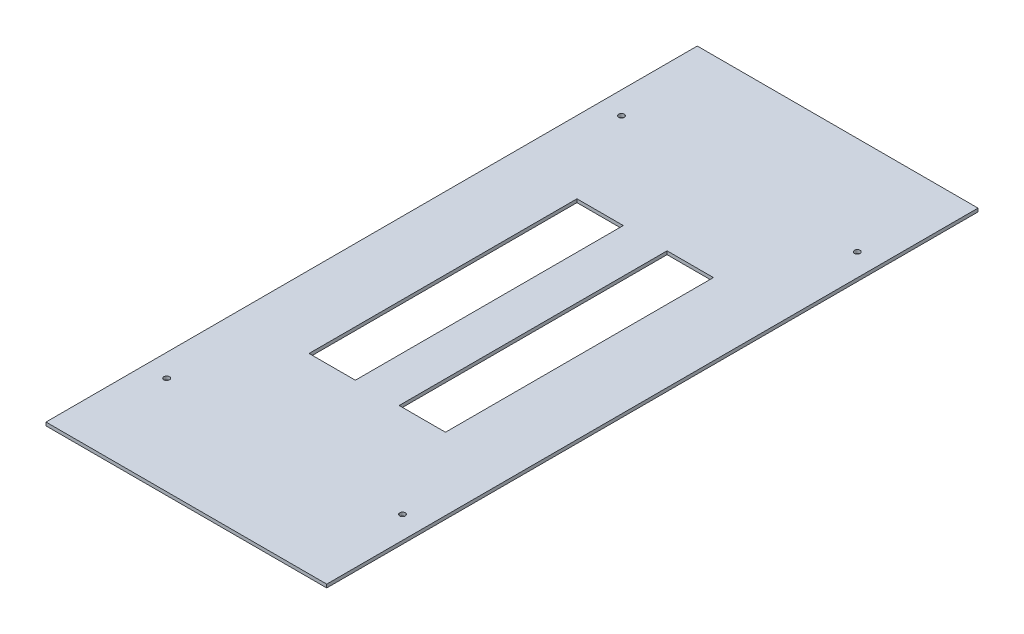
ISO-10303-21;
HEADER;
FILE_DESCRIPTION(('STEP AP214'),'2;1');
FILE_NAME('part.step','',(''),(''),'','','');
FILE_SCHEMA(('AUTOMOTIVE_DESIGN { 1 0 10303 214 1 1 1 1 }'));
ENDSEC;
DATA;
#1=APPLICATION_CONTEXT('core data for automotive mechanical design processes');
#2=APPLICATION_PROTOCOL_DEFINITION('international standard','automotive_design',2000,#1);
#3=PRODUCT_CONTEXT('',#1,'mechanical');
#4=PRODUCT('Part','Part','',(#3));
#5=PRODUCT_RELATED_PRODUCT_CATEGORY('part','',(#4));
#6=PRODUCT_DEFINITION_FORMATION('','',#4);
#7=PRODUCT_DEFINITION_CONTEXT('part definition',#1,'design');
#8=PRODUCT_DEFINITION('design','',#6,#7);
#9=PRODUCT_DEFINITION_SHAPE('','',#8);
#10=(LENGTH_UNIT() NAMED_UNIT(*) SI_UNIT(.MILLI.,.METRE.));
#11=(NAMED_UNIT(*) PLANE_ANGLE_UNIT() SI_UNIT($,.RADIAN.));
#12=(NAMED_UNIT(*) SI_UNIT($,.STERADIAN.) SOLID_ANGLE_UNIT());
#13=UNCERTAINTY_MEASURE_WITH_UNIT(LENGTH_MEASURE(1.E-05),#10,'distance_accuracy_value','');
#14=(GEOMETRIC_REPRESENTATION_CONTEXT(3) GLOBAL_UNCERTAINTY_ASSIGNED_CONTEXT((#13)) GLOBAL_UNIT_ASSIGNED_CONTEXT((#10,
#11,#12)) REPRESENTATION_CONTEXT('',''));
#15=CARTESIAN_POINT('',(0.,0.,0.));
#16=DIRECTION('',(0.,0.,1.));
#17=DIRECTION('',(1.,0.,0.));
#18=AXIS2_PLACEMENT_3D('',#15,#16,#17);
#19=CARTESIAN_POINT('',(0.,-3.,0.));
#20=DIRECTION('',(0.,1.,0.));
#21=DIRECTION('',(0.,0.,1.));
#22=AXIS2_PLACEMENT_3D('',#19,#20,#21);
#23=PLANE('',#22);
#24=DIRECTION('',(-1.,0.,0.));
#25=VECTOR('',#24,1.);
#26=CARTESIAN_POINT('',(-60.75,-3.,-118.6));
#27=LINE('',#26,#25);
#28=CARTESIAN_POINT('',(-19.5,-3.,-118.6));
#29=VERTEX_POINT('',#28);
#30=CARTESIAN_POINT('',(-60.75,-3.,-118.6));
#31=VERTEX_POINT('',#30);
#32=EDGE_CURVE('E184',#29,#31,#27,.T.);
#33=ORIENTED_EDGE('',*,*,#32,.T.);
#34=DIRECTION('',(0.,0.,1.));
#35=VECTOR('',#34,1.);
#36=CARTESIAN_POINT('',(-60.75,-3.,-118.6));
#37=LINE('',#36,#35);
#38=CARTESIAN_POINT('',(-60.75,-3.,120.));
#39=VERTEX_POINT('',#38);
#40=EDGE_CURVE('E173',#31,#39,#37,.T.);
#41=ORIENTED_EDGE('',*,*,#40,.T.);
#42=DIRECTION('',(1.,0.,0.));
#43=VECTOR('',#42,1.);
#44=CARTESIAN_POINT('',(-60.75,-3.,120.));
#45=LINE('',#44,#43);
#46=CARTESIAN_POINT('',(-19.5,-3.,120.));
#47=VERTEX_POINT('',#46);
#48=EDGE_CURVE('E177',#39,#47,#45,.T.);
#49=ORIENTED_EDGE('',*,*,#48,.T.);
#50=DIRECTION('',(0.,0.,-1.));
#51=VECTOR('',#50,1.);
#52=CARTESIAN_POINT('',(-19.5,-3.,-118.6));
#53=LINE('',#52,#51);
#54=EDGE_CURVE('E54',#47,#29,#53,.T.);
#55=ORIENTED_EDGE('',*,*,#54,.T.);
#56=EDGE_LOOP('',(#33,#41,#49,#55));
#57=FACE_BOUND('',#56,.T.);
#58=DIRECTION('',(0.,0.,-1.));
#59=VECTOR('',#58,1.);
#60=CARTESIAN_POINT('',(60.75,-3.,-118.6));
#61=LINE('',#60,#59);
#62=CARTESIAN_POINT('',(60.75,-3.,120.));
#63=VERTEX_POINT('',#62);
#64=CARTESIAN_POINT('',(60.75,-3.,-118.6));
#65=VERTEX_POINT('',#64);
#66=EDGE_CURVE('E228',#63,#65,#61,.T.);
#67=ORIENTED_EDGE('',*,*,#66,.T.);
#68=DIRECTION('',(-1.,0.,0.));
#69=VECTOR('',#68,1.);
#70=CARTESIAN_POINT('',(60.75,-3.,-118.6));
#71=LINE('',#70,#69);
#72=CARTESIAN_POINT('',(19.5,-3.,-118.6));
#73=VERTEX_POINT('',#72);
#74=EDGE_CURVE('E217',#65,#73,#71,.T.);
#75=ORIENTED_EDGE('',*,*,#74,.T.);
#76=DIRECTION('',(0.,0.,1.));
#77=VECTOR('',#76,1.);
#78=CARTESIAN_POINT('',(19.5,-3.,-118.6));
#79=LINE('',#78,#77);
#80=CARTESIAN_POINT('',(19.5,-3.,120.));
#81=VERTEX_POINT('',#80);
#82=EDGE_CURVE('E221',#73,#81,#79,.T.);
#83=ORIENTED_EDGE('',*,*,#82,.T.);
#84=DIRECTION('',(1.,0.,0.));
#85=VECTOR('',#84,1.);
#86=CARTESIAN_POINT('',(60.75,-3.,120.));
#87=LINE('',#86,#85);
#88=EDGE_CURVE('E62',#81,#63,#87,.T.);
#89=ORIENTED_EDGE('',*,*,#88,.T.);
#90=EDGE_LOOP('',(#67,#75,#83,#89));
#91=FACE_BOUND('',#90,.T.);
#92=CARTESIAN_POINT('',(-105.,-3.,-202.5));
#93=DIRECTION('',(0.,1.,0.));
#94=DIRECTION('',(0.,0.,1.));
#95=AXIS2_PLACEMENT_3D('',#92,#93,#94);
#96=CIRCLE('',#95,2.5);
#97=CARTESIAN_POINT('',(-105.,-3.,-200.));
#98=VERTEX_POINT('',#97);
#99=EDGE_CURVE('E262',#98,#98,#96,.T.);
#100=ORIENTED_EDGE('',*,*,#99,.T.);
#101=EDGE_LOOP('',(#100));
#102=FACE_BOUND('',#101,.T.);
#103=CARTESIAN_POINT('',(105.,-3.,-202.5));
#104=DIRECTION('',(0.,1.,0.));
#105=DIRECTION('',(0.,0.,1.));
#106=AXIS2_PLACEMENT_3D('',#103,#104,#105);
#107=CIRCLE('',#106,2.5);
#108=CARTESIAN_POINT('',(105.,-3.,-200.));
#109=VERTEX_POINT('',#108);
#110=EDGE_CURVE('E270',#109,#109,#107,.T.);
#111=ORIENTED_EDGE('',*,*,#110,.T.);
#112=EDGE_LOOP('',(#111));
#113=FACE_BOUND('',#112,.T.);
#114=CARTESIAN_POINT('',(105.,-3.,202.5));
#115=DIRECTION('',(0.,1.,0.));
#116=DIRECTION('',(0.,0.,1.));
#117=AXIS2_PLACEMENT_3D('',#114,#115,#116);
#118=CIRCLE('',#117,2.5);
#119=CARTESIAN_POINT('',(105.,-3.,205.));
#120=VERTEX_POINT('',#119);
#121=EDGE_CURVE('E278',#120,#120,#118,.T.);
#122=ORIENTED_EDGE('',*,*,#121,.T.);
#123=EDGE_LOOP('',(#122));
#124=FACE_BOUND('',#123,.T.);
#125=CARTESIAN_POINT('',(-105.,-3.,202.5));
#126=DIRECTION('',(0.,1.,0.));
#127=DIRECTION('',(0.,0.,1.));
#128=AXIS2_PLACEMENT_3D('',#125,#126,#127);
#129=CIRCLE('',#128,2.5);
#130=CARTESIAN_POINT('',(-105.,-3.,205.));
#131=VERTEX_POINT('',#130);
#132=EDGE_CURVE('E11',#131,#131,#129,.T.);
#133=ORIENTED_EDGE('',*,*,#132,.T.);
#134=EDGE_LOOP('',(#133));
#135=FACE_BOUND('',#134,.T.);
#136=DIRECTION('',(0.,0.,1.));
#137=VECTOR('',#136,1.);
#138=CARTESIAN_POINT('',(125.,-3.,290.));
#139=LINE('',#138,#137);
#140=CARTESIAN_POINT('',(125.,-3.,-290.));
#141=VERTEX_POINT('',#140);
#142=CARTESIAN_POINT('',(125.,-3.,290.));
#143=VERTEX_POINT('',#142);
#144=EDGE_CURVE('E136',#141,#143,#139,.T.);
#145=ORIENTED_EDGE('',*,*,#144,.T.);
#146=DIRECTION('',(-1.,0.,0.));
#147=VECTOR('',#146,1.);
#148=CARTESIAN_POINT('',(-125.,-3.,290.));
#149=LINE('',#148,#147);
#150=CARTESIAN_POINT('',(-125.,-3.,290.));
#151=VERTEX_POINT('',#150);
#152=EDGE_CURVE('E372',#143,#151,#149,.T.);
#153=ORIENTED_EDGE('',*,*,#152,.T.);
#154=DIRECTION('',(0.,0.,-1.));
#155=VECTOR('',#154,1.);
#156=CARTESIAN_POINT('',(-125.,-3.,290.));
#157=LINE('',#156,#155);
#158=CARTESIAN_POINT('',(-125.,-3.,-290.));
#159=VERTEX_POINT('',#158);
#160=EDGE_CURVE('E167',#151,#159,#157,.T.);
#161=ORIENTED_EDGE('',*,*,#160,.T.);
#162=DIRECTION('',(1.,0.,0.));
#163=VECTOR('',#162,1.);
#164=CARTESIAN_POINT('',(-125.,-3.,-290.));
#165=LINE('',#164,#163);
#166=EDGE_CURVE('E237',#159,#141,#165,.T.);
#167=ORIENTED_EDGE('',*,*,#166,.T.);
#168=EDGE_LOOP('',(#145,#153,#161,#167));
#169=FACE_BOUND('',#168,.T.);
#170=ADVANCED_FACE('F38',(#57,#91,#102,#113,#124,#135,#169),#23,.F.);
#171=CARTESIAN_POINT('',(0.,0.,0.));
#172=DIRECTION('',(0.,1.,0.));
#173=DIRECTION('',(0.,0.,1.));
#174=AXIS2_PLACEMENT_3D('',#171,#172,#173);
#175=PLANE('',#174);
#176=DIRECTION('',(0.,0.,1.));
#177=VECTOR('',#176,1.);
#178=CARTESIAN_POINT('',(-60.75,0.,-118.6));
#179=LINE('',#178,#177);
#180=CARTESIAN_POINT('',(-60.75,0.,-118.6));
#181=VERTEX_POINT('',#180);
#182=CARTESIAN_POINT('',(-60.75,0.,120.));
#183=VERTEX_POINT('',#182);
#184=EDGE_CURVE('E189',#181,#183,#179,.T.);
#185=ORIENTED_EDGE('',*,*,#184,.F.);
#186=DIRECTION('',(-1.,0.,0.));
#187=VECTOR('',#186,1.);
#188=CARTESIAN_POINT('',(-60.75,0.,-118.6));
#189=LINE('',#188,#187);
#190=CARTESIAN_POINT('',(-19.5,0.,-118.6));
#191=VERTEX_POINT('',#190);
#192=EDGE_CURVE('E178',#191,#181,#189,.T.);
#193=ORIENTED_EDGE('',*,*,#192,.F.);
#194=DIRECTION('',(0.,0.,-1.));
#195=VECTOR('',#194,1.);
#196=CARTESIAN_POINT('',(-19.5,0.,-118.6));
#197=LINE('',#196,#195);
#198=CARTESIAN_POINT('',(-19.5,0.,120.));
#199=VERTEX_POINT('',#198);
#200=EDGE_CURVE('E197',#199,#191,#197,.T.);
#201=ORIENTED_EDGE('',*,*,#200,.F.);
#202=DIRECTION('',(1.,0.,0.));
#203=VECTOR('',#202,1.);
#204=CARTESIAN_POINT('',(-60.75,0.,120.));
#205=LINE('',#204,#203);
#206=EDGE_CURVE('E192',#183,#199,#205,.T.);
#207=ORIENTED_EDGE('',*,*,#206,.F.);
#208=EDGE_LOOP('',(#185,#193,#201,#207));
#209=FACE_BOUND('',#208,.T.);
#210=DIRECTION('',(-1.,0.,0.));
#211=VECTOR('',#210,1.);
#212=CARTESIAN_POINT('',(60.75,0.,-118.6));
#213=LINE('',#212,#211);
#214=CARTESIAN_POINT('',(60.75,0.,-118.6));
#215=VERTEX_POINT('',#214);
#216=CARTESIAN_POINT('',(19.5,0.,-118.6));
#217=VERTEX_POINT('',#216);
#218=EDGE_CURVE('E233',#215,#217,#213,.T.);
#219=ORIENTED_EDGE('',*,*,#218,.F.);
#220=DIRECTION('',(0.,0.,-1.));
#221=VECTOR('',#220,1.);
#222=CARTESIAN_POINT('',(60.75,0.,-118.6));
#223=LINE('',#222,#221);
#224=CARTESIAN_POINT('',(60.75,0.,120.));
#225=VERTEX_POINT('',#224);
#226=EDGE_CURVE('E222',#225,#215,#223,.T.);
#227=ORIENTED_EDGE('',*,*,#226,.F.);
#228=DIRECTION('',(1.,0.,0.));
#229=VECTOR('',#228,1.);
#230=CARTESIAN_POINT('',(60.75,0.,120.));
#231=LINE('',#230,#229);
#232=CARTESIAN_POINT('',(19.5,0.,120.));
#233=VERTEX_POINT('',#232);
#234=EDGE_CURVE('E241',#233,#225,#231,.T.);
#235=ORIENTED_EDGE('',*,*,#234,.F.);
#236=DIRECTION('',(0.,0.,1.));
#237=VECTOR('',#236,1.);
#238=CARTESIAN_POINT('',(19.5,0.,-118.6));
#239=LINE('',#238,#237);
#240=EDGE_CURVE('E236',#217,#233,#239,.T.);
#241=ORIENTED_EDGE('',*,*,#240,.F.);
#242=EDGE_LOOP('',(#219,#227,#235,#241));
#243=FACE_BOUND('',#242,.T.);
#244=CARTESIAN_POINT('',(-105.,0.,-202.5));
#245=DIRECTION('',(0.,1.,0.));
#246=DIRECTION('',(0.,0.,1.));
#247=AXIS2_PLACEMENT_3D('',#244,#245,#246);
#248=CIRCLE('',#247,2.5);
#249=CARTESIAN_POINT('',(-105.,0.,-200.));
#250=VERTEX_POINT('',#249);
#251=EDGE_CURVE('E207',#250,#250,#248,.T.);
#252=ORIENTED_EDGE('',*,*,#251,.F.);
#253=EDGE_LOOP('',(#252));
#254=FACE_BOUND('',#253,.T.);
#255=CARTESIAN_POINT('',(105.,0.,-202.5));
#256=DIRECTION('',(0.,1.,0.));
#257=DIRECTION('',(0.,0.,1.));
#258=AXIS2_PLACEMENT_3D('',#255,#256,#257);
#259=CIRCLE('',#258,2.5);
#260=CARTESIAN_POINT('',(105.,0.,-200.));
#261=VERTEX_POINT('',#260);
#262=EDGE_CURVE('E266',#261,#261,#259,.T.);
#263=ORIENTED_EDGE('',*,*,#262,.F.);
#264=EDGE_LOOP('',(#263));
#265=FACE_BOUND('',#264,.T.);
#266=CARTESIAN_POINT('',(105.,0.,202.5));
#267=DIRECTION('',(0.,1.,0.));
#268=DIRECTION('',(0.,0.,1.));
#269=AXIS2_PLACEMENT_3D('',#266,#267,#268);
#270=CIRCLE('',#269,2.5);
#271=CARTESIAN_POINT('',(105.,0.,205.));
#272=VERTEX_POINT('',#271);
#273=EDGE_CURVE('E274',#272,#272,#270,.T.);
#274=ORIENTED_EDGE('',*,*,#273,.F.);
#275=EDGE_LOOP('',(#274));
#276=FACE_BOUND('',#275,.T.);
#277=CARTESIAN_POINT('',(-105.,0.,202.5));
#278=DIRECTION('',(0.,1.,0.));
#279=DIRECTION('',(0.,0.,1.));
#280=AXIS2_PLACEMENT_3D('',#277,#278,#279);
#281=CIRCLE('',#280,2.5);
#282=CARTESIAN_POINT('',(-105.,0.,205.));
#283=VERTEX_POINT('',#282);
#284=EDGE_CURVE('E47',#283,#283,#281,.T.);
#285=ORIENTED_EDGE('',*,*,#284,.F.);
#286=EDGE_LOOP('',(#285));
#287=FACE_BOUND('',#286,.T.);
#288=DIRECTION('',(0.,0.,-1.));
#289=VECTOR('',#288,1.);
#290=CARTESIAN_POINT('',(125.,0.,290.));
#291=LINE('',#290,#289);
#292=CARTESIAN_POINT('',(125.,0.,290.));
#293=VERTEX_POINT('',#292);
#294=CARTESIAN_POINT('',(125.,0.,-290.));
#295=VERTEX_POINT('',#294);
#296=EDGE_CURVE('E134',#293,#295,#291,.T.);
#297=ORIENTED_EDGE('',*,*,#296,.T.);
#298=DIRECTION('',(-1.,0.,0.));
#299=VECTOR('',#298,1.);
#300=CARTESIAN_POINT('',(-125.,0.,-290.));
#301=LINE('',#300,#299);
#302=CARTESIAN_POINT('',(-125.,0.,-290.));
#303=VERTEX_POINT('',#302);
#304=EDGE_CURVE('E144',#295,#303,#301,.T.);
#305=ORIENTED_EDGE('',*,*,#304,.T.);
#306=DIRECTION('',(0.,0.,1.));
#307=VECTOR('',#306,1.);
#308=CARTESIAN_POINT('',(-125.,0.,290.));
#309=LINE('',#308,#307);
#310=CARTESIAN_POINT('',(-125.,0.,290.));
#311=VERTEX_POINT('',#310);
#312=EDGE_CURVE('E151',#303,#311,#309,.T.);
#313=ORIENTED_EDGE('',*,*,#312,.T.);
#314=DIRECTION('',(1.,0.,0.));
#315=VECTOR('',#314,1.);
#316=CARTESIAN_POINT('',(-125.,0.,290.));
#317=LINE('',#316,#315);
#318=EDGE_CURVE('E141',#311,#293,#317,.T.);
#319=ORIENTED_EDGE('',*,*,#318,.T.);
#320=EDGE_LOOP('',(#297,#305,#313,#319));
#321=FACE_BOUND('',#320,.T.);
#322=ADVANCED_FACE('F40',(#209,#243,#254,#265,#276,#287,#321),#175,.T.);
#323=CARTESIAN_POINT('',(-105.,0.,202.5));
#324=DIRECTION('',(0.,1.,0.));
#325=DIRECTION('',(0.,0.,1.));
#326=AXIS2_PLACEMENT_3D('',#323,#324,#325);
#327=CYLINDRICAL_SURFACE('',#326,2.5);
#328=ORIENTED_EDGE('',*,*,#132,.F.);
#329=EDGE_LOOP('',(#328));
#330=FACE_BOUND('',#329,.T.);
#331=ORIENTED_EDGE('',*,*,#284,.T.);
#332=EDGE_LOOP('',(#331));
#333=FACE_BOUND('',#332,.T.);
#334=ADVANCED_FACE('F286',(#330,#333),#327,.F.);
#335=CARTESIAN_POINT('',(105.,0.,202.5));
#336=DIRECTION('',(0.,1.,0.));
#337=DIRECTION('',(0.,0.,1.));
#338=AXIS2_PLACEMENT_3D('',#335,#336,#337);
#339=CYLINDRICAL_SURFACE('',#338,2.5);
#340=ORIENTED_EDGE('',*,*,#121,.F.);
#341=EDGE_LOOP('',(#340));
#342=FACE_BOUND('',#341,.T.);
#343=ORIENTED_EDGE('',*,*,#273,.T.);
#344=EDGE_LOOP('',(#343));
#345=FACE_BOUND('',#344,.T.);
#346=ADVANCED_FACE('F294',(#342,#345),#339,.F.);
#347=CARTESIAN_POINT('',(105.,0.,-202.5));
#348=DIRECTION('',(0.,1.,0.));
#349=DIRECTION('',(0.,0.,1.));
#350=AXIS2_PLACEMENT_3D('',#347,#348,#349);
#351=CYLINDRICAL_SURFACE('',#350,2.5);
#352=ORIENTED_EDGE('',*,*,#110,.F.);
#353=EDGE_LOOP('',(#352));
#354=FACE_BOUND('',#353,.T.);
#355=ORIENTED_EDGE('',*,*,#262,.T.);
#356=EDGE_LOOP('',(#355));
#357=FACE_BOUND('',#356,.T.);
#358=ADVANCED_FACE('F313',(#354,#357),#351,.F.);
#359=CARTESIAN_POINT('',(-105.,0.,-202.5));
#360=DIRECTION('',(0.,1.,0.));
#361=DIRECTION('',(0.,0.,1.));
#362=AXIS2_PLACEMENT_3D('',#359,#360,#361);
#363=CYLINDRICAL_SURFACE('',#362,2.5);
#364=ORIENTED_EDGE('',*,*,#99,.F.);
#365=EDGE_LOOP('',(#364));
#366=FACE_BOUND('',#365,.T.);
#367=ORIENTED_EDGE('',*,*,#251,.T.);
#368=EDGE_LOOP('',(#367));
#369=FACE_BOUND('',#368,.T.);
#370=ADVANCED_FACE('F319',(#366,#369),#363,.F.);
#371=CARTESIAN_POINT('',(60.75,-3.,-118.6));
#372=DIRECTION('',(0.,0.,-1.));
#373=DIRECTION('',(-1.,0.,0.));
#374=AXIS2_PLACEMENT_3D('',#371,#372,#373);
#375=PLANE('',#374);
#376=ORIENTED_EDGE('',*,*,#218,.T.);
#377=DIRECTION('',(0.,1.,0.));
#378=VECTOR('',#377,1.);
#379=CARTESIAN_POINT('',(19.5,-3.,-118.6));
#380=LINE('',#379,#378);
#381=EDGE_CURVE('E232',#73,#217,#380,.T.);
#382=ORIENTED_EDGE('',*,*,#381,.F.);
#383=ORIENTED_EDGE('',*,*,#74,.F.);
#384=DIRECTION('',(0.,1.,0.));
#385=VECTOR('',#384,1.);
#386=CARTESIAN_POINT('',(60.75,-3.,-118.6));
#387=LINE('',#386,#385);
#388=EDGE_CURVE('E193',#65,#215,#387,.T.);
#389=ORIENTED_EDGE('',*,*,#388,.T.);
#390=EDGE_LOOP('',(#376,#382,#383,#389));
#391=FACE_BOUND('',#390,.T.);
#392=ADVANCED_FACE('F326',(#391),#375,.F.);
#393=CARTESIAN_POINT('',(60.75,-3.,-118.6));
#394=DIRECTION('',(1.,0.,0.));
#395=DIRECTION('',(0.,0.,-1.));
#396=AXIS2_PLACEMENT_3D('',#393,#394,#395);
#397=PLANE('',#396);
#398=ORIENTED_EDGE('',*,*,#226,.T.);
#399=ORIENTED_EDGE('',*,*,#388,.F.);
#400=ORIENTED_EDGE('',*,*,#66,.F.);
#401=DIRECTION('',(0.,1.,0.));
#402=VECTOR('',#401,1.);
#403=CARTESIAN_POINT('',(60.75,-3.,120.));
#404=LINE('',#403,#402);
#405=EDGE_CURVE('E250',#63,#225,#404,.T.);
#406=ORIENTED_EDGE('',*,*,#405,.T.);
#407=EDGE_LOOP('',(#398,#399,#400,#406));
#408=FACE_BOUND('',#407,.T.);
#409=ADVANCED_FACE('F330',(#408),#397,.F.);
#410=CARTESIAN_POINT('',(60.75,-3.,120.));
#411=DIRECTION('',(0.,0.,1.));
#412=DIRECTION('',(1.,0.,0.));
#413=AXIS2_PLACEMENT_3D('',#410,#411,#412);
#414=PLANE('',#413);
#415=ORIENTED_EDGE('',*,*,#234,.T.);
#416=ORIENTED_EDGE('',*,*,#405,.F.);
#417=ORIENTED_EDGE('',*,*,#88,.F.);
#418=DIRECTION('',(0.,1.,0.));
#419=VECTOR('',#418,1.);
#420=CARTESIAN_POINT('',(19.5,-3.,120.));
#421=LINE('',#420,#419);
#422=EDGE_CURVE('E253',#81,#233,#421,.T.);
#423=ORIENTED_EDGE('',*,*,#422,.T.);
#424=EDGE_LOOP('',(#415,#416,#417,#423));
#425=FACE_BOUND('',#424,.T.);
#426=ADVANCED_FACE('F336',(#425),#414,.F.);
#427=CARTESIAN_POINT('',(19.5,-3.,-118.6));
#428=DIRECTION('',(-1.,0.,0.));
#429=DIRECTION('',(0.,0.,1.));
#430=AXIS2_PLACEMENT_3D('',#427,#428,#429);
#431=PLANE('',#430);
#432=ORIENTED_EDGE('',*,*,#240,.T.);
#433=ORIENTED_EDGE('',*,*,#422,.F.);
#434=ORIENTED_EDGE('',*,*,#82,.F.);
#435=ORIENTED_EDGE('',*,*,#381,.T.);
#436=EDGE_LOOP('',(#432,#433,#434,#435));
#437=FACE_BOUND('',#436,.T.);
#438=ADVANCED_FACE('F332',(#437),#431,.F.);
#439=CARTESIAN_POINT('',(-60.75,-3.,-118.6));
#440=DIRECTION('',(-1.,0.,0.));
#441=DIRECTION('',(0.,0.,1.));
#442=AXIS2_PLACEMENT_3D('',#439,#440,#441);
#443=PLANE('',#442);
#444=ORIENTED_EDGE('',*,*,#184,.T.);
#445=DIRECTION('',(0.,1.,0.));
#446=VECTOR('',#445,1.);
#447=CARTESIAN_POINT('',(-60.75,-3.,120.));
#448=LINE('',#447,#446);
#449=EDGE_CURVE('E188',#39,#183,#448,.T.);
#450=ORIENTED_EDGE('',*,*,#449,.F.);
#451=ORIENTED_EDGE('',*,*,#40,.F.);
#452=DIRECTION('',(0.,1.,0.));
#453=VECTOR('',#452,1.);
#454=CARTESIAN_POINT('',(-60.75,-3.,-118.6));
#455=LINE('',#454,#453);
#456=EDGE_CURVE('E204',#31,#181,#455,.T.);
#457=ORIENTED_EDGE('',*,*,#456,.T.);
#458=EDGE_LOOP('',(#444,#450,#451,#457));
#459=FACE_BOUND('',#458,.T.);
#460=ADVANCED_FACE('F335',(#459),#443,.F.);
#461=CARTESIAN_POINT('',(-60.75,-3.,-118.6));
#462=DIRECTION('',(0.,0.,-1.));
#463=DIRECTION('',(-1.,0.,0.));
#464=AXIS2_PLACEMENT_3D('',#461,#462,#463);
#465=PLANE('',#464);
#466=ORIENTED_EDGE('',*,*,#192,.T.);
#467=ORIENTED_EDGE('',*,*,#456,.F.);
#468=ORIENTED_EDGE('',*,*,#32,.F.);
#469=DIRECTION('',(0.,1.,0.));
#470=VECTOR('',#469,1.);
#471=CARTESIAN_POINT('',(-19.5,-3.,-118.6));
#472=LINE('',#471,#470);
#473=EDGE_CURVE('E208',#29,#191,#472,.T.);
#474=ORIENTED_EDGE('',*,*,#473,.T.);
#475=EDGE_LOOP('',(#466,#467,#468,#474));
#476=FACE_BOUND('',#475,.T.);
#477=ADVANCED_FACE('F345',(#476),#465,.F.);
#478=CARTESIAN_POINT('',(-19.5,-3.,-118.6));
#479=DIRECTION('',(1.,0.,0.));
#480=DIRECTION('',(0.,0.,-1.));
#481=AXIS2_PLACEMENT_3D('',#478,#479,#480);
#482=PLANE('',#481);
#483=ORIENTED_EDGE('',*,*,#200,.T.);
#484=ORIENTED_EDGE('',*,*,#473,.F.);
#485=ORIENTED_EDGE('',*,*,#54,.F.);
#486=DIRECTION('',(0.,1.,0.));
#487=VECTOR('',#486,1.);
#488=CARTESIAN_POINT('',(-19.5,-3.,120.));
#489=LINE('',#488,#487);
#490=EDGE_CURVE('E211',#47,#199,#489,.T.);
#491=ORIENTED_EDGE('',*,*,#490,.T.);
#492=EDGE_LOOP('',(#483,#484,#485,#491));
#493=FACE_BOUND('',#492,.T.);
#494=ADVANCED_FACE('F350',(#493),#482,.F.);
#495=CARTESIAN_POINT('',(-60.75,-3.,120.));
#496=DIRECTION('',(0.,0.,1.));
#497=DIRECTION('',(1.,0.,0.));
#498=AXIS2_PLACEMENT_3D('',#495,#496,#497);
#499=PLANE('',#498);
#500=ORIENTED_EDGE('',*,*,#206,.T.);
#501=ORIENTED_EDGE('',*,*,#490,.F.);
#502=ORIENTED_EDGE('',*,*,#48,.F.);
#503=ORIENTED_EDGE('',*,*,#449,.T.);
#504=EDGE_LOOP('',(#500,#501,#502,#503));
#505=FACE_BOUND('',#504,.T.);
#506=ADVANCED_FACE('F347',(#505),#499,.F.);
#507=CARTESIAN_POINT('',(-125.,-634.585306985525,-290.));
#508=DIRECTION('',(0.,0.,-1.));
#509=DIRECTION('',(-1.,0.,0.));
#510=AXIS2_PLACEMENT_3D('',#507,#508,#509);
#511=PLANE('',#510);
#512=ORIENTED_EDGE('',*,*,#166,.F.);
#513=DIRECTION('',(0.,1.,0.));
#514=VECTOR('',#513,1.);
#515=CARTESIAN_POINT('',(-125.,-634.585306985525,-290.));
#516=LINE('',#515,#514);
#517=EDGE_CURVE('E140',#159,#303,#516,.T.);
#518=ORIENTED_EDGE('',*,*,#517,.T.);
#519=ORIENTED_EDGE('',*,*,#304,.F.);
#520=DIRECTION('',(0.,1.,0.));
#521=VECTOR('',#520,1.);
#522=CARTESIAN_POINT('',(125.,-634.585306985525,-290.));
#523=LINE('',#522,#521);
#524=EDGE_CURVE('E129',#141,#295,#523,.T.);
#525=ORIENTED_EDGE('',*,*,#524,.F.);
#526=EDGE_LOOP('',(#512,#518,#519,#525));
#527=FACE_BOUND('',#526,.T.);
#528=ADVANCED_FACE('F145',(#527),#511,.T.);
#529=CARTESIAN_POINT('',(-125.,-634.585306985525,290.));
#530=DIRECTION('',(-1.,0.,0.));
#531=DIRECTION('',(0.,0.,1.));
#532=AXIS2_PLACEMENT_3D('',#529,#530,#531);
#533=PLANE('',#532);
#534=ORIENTED_EDGE('',*,*,#160,.F.);
#535=DIRECTION('',(0.,1.,0.));
#536=VECTOR('',#535,1.);
#537=CARTESIAN_POINT('',(-125.,-634.585306985525,290.));
#538=LINE('',#537,#536);
#539=EDGE_CURVE('E168',#151,#311,#538,.T.);
#540=ORIENTED_EDGE('',*,*,#539,.T.);
#541=ORIENTED_EDGE('',*,*,#312,.F.);
#542=ORIENTED_EDGE('',*,*,#517,.F.);
#543=EDGE_LOOP('',(#534,#540,#541,#542));
#544=FACE_BOUND('',#543,.T.);
#545=ADVANCED_FACE('F362',(#544),#533,.T.);
#546=CARTESIAN_POINT('',(-125.,-634.585306985525,290.));
#547=DIRECTION('',(0.,0.,1.));
#548=DIRECTION('',(1.,0.,0.));
#549=AXIS2_PLACEMENT_3D('',#546,#547,#548);
#550=PLANE('',#549);
#551=ORIENTED_EDGE('',*,*,#152,.F.);
#552=DIRECTION('',(0.,1.,0.));
#553=VECTOR('',#552,1.);
#554=CARTESIAN_POINT('',(125.,-634.585306985525,290.));
#555=LINE('',#554,#553);
#556=EDGE_CURVE('E164',#143,#293,#555,.T.);
#557=ORIENTED_EDGE('',*,*,#556,.T.);
#558=ORIENTED_EDGE('',*,*,#318,.F.);
#559=ORIENTED_EDGE('',*,*,#539,.F.);
#560=EDGE_LOOP('',(#551,#557,#558,#559));
#561=FACE_BOUND('',#560,.T.);
#562=ADVANCED_FACE('F359',(#561),#550,.T.);
#563=CARTESIAN_POINT('',(125.,-634.585306985525,290.));
#564=DIRECTION('',(1.,0.,0.));
#565=DIRECTION('',(0.,0.,-1.));
#566=AXIS2_PLACEMENT_3D('',#563,#564,#565);
#567=PLANE('',#566);
#568=ORIENTED_EDGE('',*,*,#144,.F.);
#569=ORIENTED_EDGE('',*,*,#524,.T.);
#570=ORIENTED_EDGE('',*,*,#296,.F.);
#571=ORIENTED_EDGE('',*,*,#556,.F.);
#572=EDGE_LOOP('',(#568,#569,#570,#571));
#573=FACE_BOUND('',#572,.T.);
#574=ADVANCED_FACE('F131',(#573),#567,.T.);
#575=CLOSED_SHELL('',(#170,#322,#334,#346,#358,#370,#392,#409,#426,#438,#460,#477,#494,#506,
#528,#545,#562,#574));
#576=MANIFOLD_SOLID_BREP('B2',#575);
#577=ADVANCED_BREP_SHAPE_REPRESENTATION('',(#18,#576),#14);
#578=SHAPE_DEFINITION_REPRESENTATION(#9,#577);
ENDSEC;
END-ISO-10303-21;
